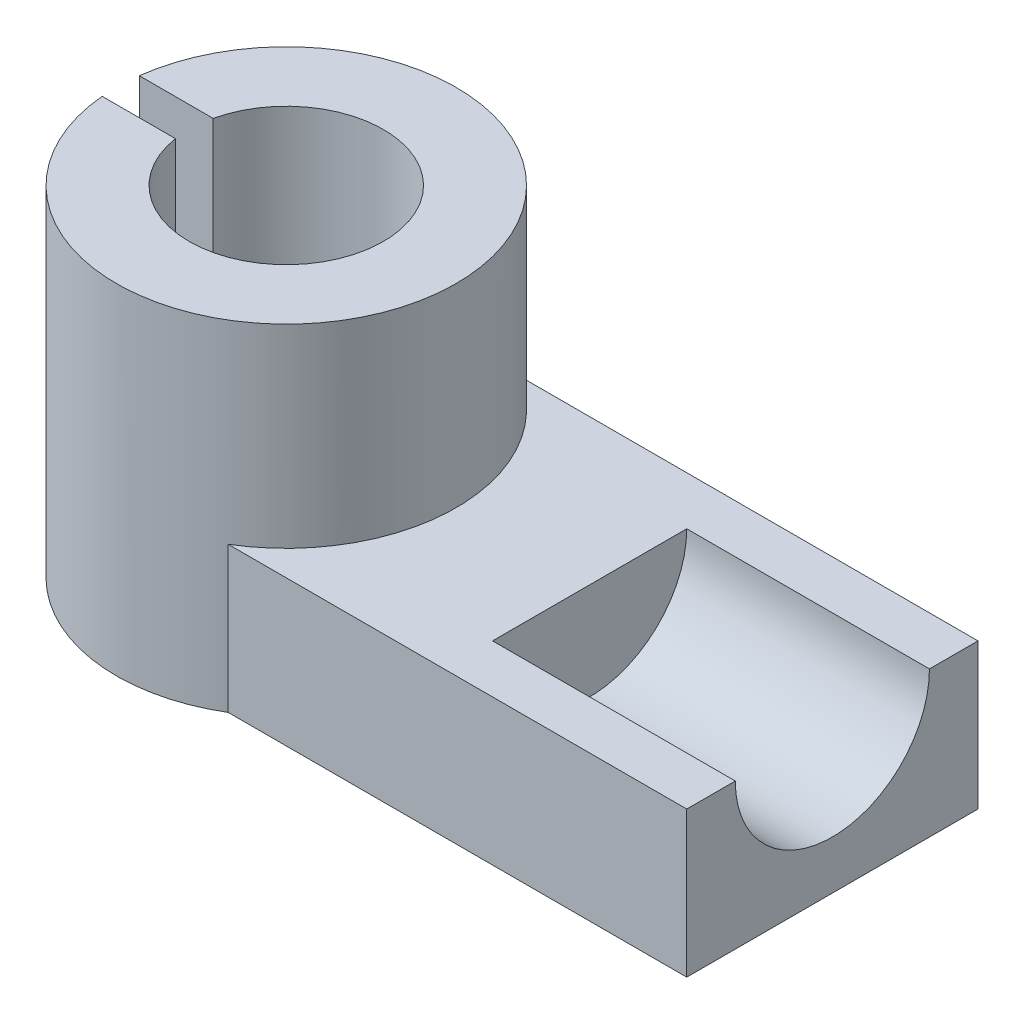
ISO-10303-21;
HEADER;
FILE_DESCRIPTION(('STEP AP214'),'2;1');
FILE_NAME('part.step','',(''),(''),'','','');
FILE_SCHEMA(('AUTOMOTIVE_DESIGN { 1 0 10303 214 1 1 1 1 }'));
ENDSEC;
DATA;
#1=APPLICATION_CONTEXT('core data for automotive mechanical design processes');
#2=APPLICATION_PROTOCOL_DEFINITION('international standard','automotive_design',2000,#1);
#3=PRODUCT_CONTEXT('',#1,'mechanical');
#4=PRODUCT('Part','Part','',(#3));
#5=PRODUCT_RELATED_PRODUCT_CATEGORY('part','',(#4));
#6=PRODUCT_DEFINITION_FORMATION('','',#4);
#7=PRODUCT_DEFINITION_CONTEXT('part definition',#1,'design');
#8=PRODUCT_DEFINITION('design','',#6,#7);
#9=PRODUCT_DEFINITION_SHAPE('','',#8);
#10=(LENGTH_UNIT() NAMED_UNIT(*) SI_UNIT(.MILLI.,.METRE.));
#11=(NAMED_UNIT(*) PLANE_ANGLE_UNIT() SI_UNIT($,.RADIAN.));
#12=(NAMED_UNIT(*) SI_UNIT($,.STERADIAN.) SOLID_ANGLE_UNIT());
#13=UNCERTAINTY_MEASURE_WITH_UNIT(LENGTH_MEASURE(1.E-05),#10,'distance_accuracy_value','');
#14=(GEOMETRIC_REPRESENTATION_CONTEXT(3) GLOBAL_UNCERTAINTY_ASSIGNED_CONTEXT((#13)) GLOBAL_UNIT_ASSIGNED_CONTEXT((#10,
#11,#12)) REPRESENTATION_CONTEXT('',''));
#15=CARTESIAN_POINT('',(0.,0.,0.));
#16=DIRECTION('',(0.,0.,1.));
#17=DIRECTION('',(1.,0.,0.));
#18=AXIS2_PLACEMENT_3D('',#15,#16,#17);
#19=CARTESIAN_POINT('',(0.,24.,0.));
#20=DIRECTION('',(0.,0.,-1.));
#21=DIRECTION('',(-1.,0.,0.));
#22=AXIS2_PLACEMENT_3D('',#19,#20,#21);
#23=PLANE('',#22);
#24=DIRECTION('',(1.,0.,0.));
#25=VECTOR('',#24,1.);
#26=CARTESIAN_POINT('',(0.,0.,0.));
#27=LINE('',#26,#25);
#28=CARTESIAN_POINT('',(14.422205101856,0.,0.));
#29=VERTEX_POINT('',#28);
#30=CARTESIAN_POINT('',(90.,0.,0.));
#31=VERTEX_POINT('',#30);
#32=EDGE_CURVE('E152',#29,#31,#27,.T.);
#33=ORIENTED_EDGE('',*,*,#32,.T.);
#34=DIRECTION('',(0.,-1.,0.));
#35=VECTOR('',#34,1.);
#36=CARTESIAN_POINT('',(90.,24.,0.));
#37=LINE('',#36,#35);
#38=CARTESIAN_POINT('',(90.,24.,0.));
#39=VERTEX_POINT('',#38);
#40=EDGE_CURVE('E168',#39,#31,#37,.T.);
#41=ORIENTED_EDGE('',*,*,#40,.F.);
#42=DIRECTION('',(1.,0.,0.));
#43=VECTOR('',#42,1.);
#44=CARTESIAN_POINT('',(0.,24.,0.));
#45=LINE('',#44,#43);
#46=CARTESIAN_POINT('',(14.422205101856,24.,0.));
#47=VERTEX_POINT('',#46);
#48=EDGE_CURVE('E140',#47,#39,#45,.T.);
#49=ORIENTED_EDGE('',*,*,#48,.F.);
#50=DIRECTION('',(0.,-1.,0.));
#51=VECTOR('',#50,1.);
#52=CARTESIAN_POINT('',(14.422205101856,24.,0.));
#53=LINE('',#52,#51);
#54=EDGE_CURVE('E172',#47,#29,#53,.T.);
#55=ORIENTED_EDGE('',*,*,#54,.T.);
#56=EDGE_LOOP('',(#33,#41,#49,#55));
#57=FACE_BOUND('',#56,.T.);
#58=ADVANCED_FACE('F41',(#57),#23,.F.);
#59=CARTESIAN_POINT('',(90.,24.,0.));
#60=DIRECTION('',(-1.,0.,0.));
#61=DIRECTION('',(0.,0.,1.));
#62=AXIS2_PLACEMENT_3D('',#59,#60,#61);
#63=PLANE('',#62);
#64=DIRECTION('',(0.,0.,-1.));
#65=VECTOR('',#64,1.);
#66=CARTESIAN_POINT('',(90.,24.,0.));
#67=LINE('',#66,#65);
#68=CARTESIAN_POINT('',(90.,24.,-40.));
#69=VERTEX_POINT('',#68);
#70=CARTESIAN_POINT('',(90.,24.,-48.));
#71=VERTEX_POINT('',#70);
#72=EDGE_CURVE('E130',#69,#71,#67,.T.);
#73=ORIENTED_EDGE('',*,*,#72,.F.);
#74=CARTESIAN_POINT('',(90.,24.,-24.));
#75=DIRECTION('',(1.,0.,0.));
#76=DIRECTION('',(0.,0.,-1.));
#77=AXIS2_PLACEMENT_3D('',#74,#75,#76);
#78=CIRCLE('',#77,16.);
#79=CARTESIAN_POINT('',(90.,24.,-7.99999999999998));
#80=VERTEX_POINT('',#79);
#81=EDGE_CURVE('E116',#80,#69,#78,.T.);
#82=ORIENTED_EDGE('',*,*,#81,.F.);
#83=EDGE_CURVE('E139',#39,#80,#67,.T.);
#84=ORIENTED_EDGE('',*,*,#83,.F.);
#85=ORIENTED_EDGE('',*,*,#40,.T.);
#86=DIRECTION('',(0.,0.,-1.));
#87=VECTOR('',#86,1.);
#88=CARTESIAN_POINT('',(90.,0.,0.));
#89=LINE('',#88,#87);
#90=CARTESIAN_POINT('',(90.,0.,-48.));
#91=VERTEX_POINT('',#90);
#92=EDGE_CURVE('E155',#31,#91,#89,.T.);
#93=ORIENTED_EDGE('',*,*,#92,.T.);
#94=DIRECTION('',(0.,-1.,0.));
#95=VECTOR('',#94,1.);
#96=CARTESIAN_POINT('',(90.,24.,-48.));
#97=LINE('',#96,#95);
#98=EDGE_CURVE('E136',#71,#91,#97,.T.);
#99=ORIENTED_EDGE('',*,*,#98,.F.);
#100=EDGE_LOOP('',(#73,#82,#84,#85,#93,#99));
#101=FACE_BOUND('',#100,.T.);
#102=ADVANCED_FACE('F134',(#101),#63,.F.);
#103=CARTESIAN_POINT('',(0.,24.,-48.));
#104=DIRECTION('',(0.,0.,-1.));
#105=DIRECTION('',(-1.,0.,0.));
#106=AXIS2_PLACEMENT_3D('',#103,#104,#105);
#107=PLANE('',#106);
#108=DIRECTION('',(1.,0.,0.));
#109=VECTOR('',#108,1.);
#110=CARTESIAN_POINT('',(0.,0.,-48.));
#111=LINE('',#110,#109);
#112=CARTESIAN_POINT('',(14.422205101856,0.,-48.));
#113=VERTEX_POINT('',#112);
#114=EDGE_CURVE('E159',#113,#91,#111,.T.);
#115=ORIENTED_EDGE('',*,*,#114,.F.);
#116=DIRECTION('',(0.,-1.,0.));
#117=VECTOR('',#116,1.);
#118=CARTESIAN_POINT('',(14.422205101856,24.,-48.));
#119=LINE('',#118,#117);
#120=CARTESIAN_POINT('',(14.422205101856,24.,-48.));
#121=VERTEX_POINT('',#120);
#122=EDGE_CURVE('E151',#121,#113,#119,.T.);
#123=ORIENTED_EDGE('',*,*,#122,.F.);
#124=DIRECTION('',(1.,0.,0.));
#125=VECTOR('',#124,1.);
#126=CARTESIAN_POINT('',(0.,24.,-48.));
#127=LINE('',#126,#125);
#128=EDGE_CURVE('E144',#121,#71,#127,.T.);
#129=ORIENTED_EDGE('',*,*,#128,.T.);
#130=ORIENTED_EDGE('',*,*,#98,.T.);
#131=EDGE_LOOP('',(#115,#123,#129,#130));
#132=FACE_BOUND('',#131,.T.);
#133=ADVANCED_FACE('F224',(#132),#107,.T.);
#134=CARTESIAN_POINT('',(0.,24.,0.));
#135=DIRECTION('',(0.,1.,0.));
#136=DIRECTION('',(0.,0.,1.));
#137=AXIS2_PLACEMENT_3D('',#134,#135,#136);
#138=PLANE('',#137);
#139=DIRECTION('',(1.,0.,0.));
#140=VECTOR('',#139,1.);
#141=CARTESIAN_POINT('',(50.,24.,-7.99999999999998));
#142=LINE('',#141,#140);
#143=CARTESIAN_POINT('',(50.,24.,-7.99999999999998));
#144=VERTEX_POINT('',#143);
#145=EDGE_CURVE('E11',#144,#80,#142,.T.);
#146=ORIENTED_EDGE('',*,*,#145,.F.);
#147=DIRECTION('',(0.,0.,-1.));
#148=VECTOR('',#147,1.);
#149=CARTESIAN_POINT('',(50.,24.,0.));
#150=LINE('',#149,#148);
#151=CARTESIAN_POINT('',(50.,24.,-40.));
#152=VERTEX_POINT('',#151);
#153=EDGE_CURVE('E132',#144,#152,#150,.T.);
#154=ORIENTED_EDGE('',*,*,#153,.T.);
#155=DIRECTION('',(1.,0.,0.));
#156=VECTOR('',#155,1.);
#157=CARTESIAN_POINT('',(50.,24.,-40.));
#158=LINE('',#157,#156);
#159=EDGE_CURVE('E49',#69,#152,#158,.F.);
#160=ORIENTED_EDGE('',*,*,#159,.F.);
#161=ORIENTED_EDGE('',*,*,#72,.T.);
#162=ORIENTED_EDGE('',*,*,#128,.F.);
#163=CARTESIAN_POINT('',(0.,24.,-24.));
#164=DIRECTION('',(0.,1.,0.));
#165=DIRECTION('',(0.,0.,1.));
#166=AXIS2_PLACEMENT_3D('',#163,#164,#165);
#167=CIRCLE('',#166,28.);
#168=EDGE_CURVE('E145',#47,#121,#167,.T.);
#169=ORIENTED_EDGE('',*,*,#168,.F.);
#170=ORIENTED_EDGE('',*,*,#48,.T.);
#171=ORIENTED_EDGE('',*,*,#83,.T.);
#172=EDGE_LOOP('',(#146,#154,#160,#161,#162,#169,#170,#171));
#173=FACE_BOUND('',#172,.T.);
#174=ADVANCED_FACE('F128',(#173),#138,.T.);
#175=CARTESIAN_POINT('',(0.,0.,0.));
#176=DIRECTION('',(0.,1.,0.));
#177=DIRECTION('',(0.,0.,1.));
#178=AXIS2_PLACEMENT_3D('',#175,#176,#177);
#179=PLANE('',#178);
#180=CARTESIAN_POINT('',(0.,0.,-24.));
#181=DIRECTION('',(0.,1.,0.));
#182=DIRECTION('',(0.,0.,1.));
#183=AXIS2_PLACEMENT_3D('',#180,#181,#182);
#184=CIRCLE('',#183,28.);
#185=CARTESIAN_POINT('',(-27.892800444766,0.,-21.5522084752856));
#186=VERTEX_POINT('',#185);
#187=EDGE_CURVE('E211',#186,#29,#184,.T.);
#188=ORIENTED_EDGE('',*,*,#187,.F.);
#189=DIRECTION('',(1.,0.,0.));
#190=VECTOR('',#189,1.);
#191=CARTESIAN_POINT('',(-40.6619448927141,0.,-21.5522084752856));
#192=LINE('',#191,#190);
#193=CARTESIAN_POINT('',(-15.8116512942683,0.,-21.5522084752856));
#194=VERTEX_POINT('',#193);
#195=EDGE_CURVE('E238',#186,#194,#192,.T.);
#196=ORIENTED_EDGE('',*,*,#195,.T.);
#197=CARTESIAN_POINT('',(0.,0.,-24.));
#198=DIRECTION('',(0.,1.,0.));
#199=DIRECTION('',(0.,0.,1.));
#200=AXIS2_PLACEMENT_3D('',#197,#198,#199);
#201=CIRCLE('',#200,16.);
#202=CARTESIAN_POINT('',(-15.6006991813864,0.,-27.5522084752856));
#203=VERTEX_POINT('',#202);
#204=EDGE_CURVE('E198',#194,#203,#201,.T.);
#205=ORIENTED_EDGE('',*,*,#204,.T.);
#206=DIRECTION('',(-1.,0.,0.));
#207=VECTOR('',#206,1.);
#208=CARTESIAN_POINT('',(-40.6619448927141,0.,-27.5522084752856));
#209=LINE('',#208,#207);
#210=CARTESIAN_POINT('',(-27.7737612675725,0.,-27.5522084752856));
#211=VERTEX_POINT('',#210);
#212=EDGE_CURVE('E231',#203,#211,#209,.T.);
#213=ORIENTED_EDGE('',*,*,#212,.T.);
#214=EDGE_CURVE('E205',#113,#211,#184,.T.);
#215=ORIENTED_EDGE('',*,*,#214,.F.);
#216=ORIENTED_EDGE('',*,*,#114,.T.);
#217=ORIENTED_EDGE('',*,*,#92,.F.);
#218=ORIENTED_EDGE('',*,*,#32,.F.);
#219=EDGE_LOOP('',(#188,#196,#205,#213,#215,#216,#217,#218));
#220=FACE_BOUND('',#219,.T.);
#221=ADVANCED_FACE('F228',(#220),#179,.F.);
#222=CARTESIAN_POINT('',(0.,56.,-24.));
#223=DIRECTION('',(0.,-1.,0.));
#224=DIRECTION('',(0.,0.,-1.));
#225=AXIS2_PLACEMENT_3D('',#222,#223,#224);
#226=CYLINDRICAL_SURFACE('',#225,28.);
#227=CARTESIAN_POINT('',(0.,56.,-24.));
#228=DIRECTION('',(0.,1.,0.));
#229=DIRECTION('',(0.,0.,1.));
#230=AXIS2_PLACEMENT_3D('',#227,#228,#229);
#231=CIRCLE('',#230,28.);
#232=CARTESIAN_POINT('',(-27.892800444766,56.,-21.5522084752856));
#233=VERTEX_POINT('',#232);
#234=CARTESIAN_POINT('',(-27.7737612675725,56.,-27.5522084752856));
#235=VERTEX_POINT('',#234);
#236=EDGE_CURVE('E156',#233,#235,#231,.T.);
#237=ORIENTED_EDGE('',*,*,#236,.F.);
#238=DIRECTION('',(0.,-1.,0.));
#239=VECTOR('',#238,1.);
#240=CARTESIAN_POINT('',(-27.892800444766,56.,-21.5522084752856));
#241=LINE('',#240,#239);
#242=EDGE_CURVE('E63',#233,#186,#241,.T.);
#243=ORIENTED_EDGE('',*,*,#242,.T.);
#244=ORIENTED_EDGE('',*,*,#187,.T.);
#245=ORIENTED_EDGE('',*,*,#54,.F.);
#246=ORIENTED_EDGE('',*,*,#168,.T.);
#247=ORIENTED_EDGE('',*,*,#122,.T.);
#248=ORIENTED_EDGE('',*,*,#214,.T.);
#249=DIRECTION('',(0.,-1.,0.));
#250=VECTOR('',#249,1.);
#251=CARTESIAN_POINT('',(-27.7737612675725,56.,-27.5522084752856));
#252=LINE('',#251,#250);
#253=EDGE_CURVE('E200',#211,#235,#252,.F.);
#254=ORIENTED_EDGE('',*,*,#253,.T.);
#255=EDGE_LOOP('',(#237,#243,#244,#245,#246,#247,#248,#254));
#256=FACE_BOUND('',#255,.T.);
#257=ADVANCED_FACE('F220',(#256),#226,.T.);
#258=CARTESIAN_POINT('',(0.,56.,-24.));
#259=DIRECTION('',(0.,-1.,0.));
#260=DIRECTION('',(0.,0.,-1.));
#261=AXIS2_PLACEMENT_3D('',#258,#259,#260);
#262=CYLINDRICAL_SURFACE('',#261,16.);
#263=DIRECTION('',(0.,-1.,0.));
#264=VECTOR('',#263,1.);
#265=CARTESIAN_POINT('',(-15.8116512942683,56.,-21.5522084752856));
#266=LINE('',#265,#264);
#267=CARTESIAN_POINT('',(-15.8116512942683,56.,-21.5522084752856));
#268=VERTEX_POINT('',#267);
#269=EDGE_CURVE('E185',#268,#194,#266,.T.);
#270=ORIENTED_EDGE('',*,*,#269,.F.);
#271=CARTESIAN_POINT('',(0.,56.,-24.));
#272=DIRECTION('',(0.,1.,0.));
#273=DIRECTION('',(0.,0.,1.));
#274=AXIS2_PLACEMENT_3D('',#271,#272,#273);
#275=CIRCLE('',#274,16.);
#276=CARTESIAN_POINT('',(-15.6006991813864,56.,-27.5522084752856));
#277=VERTEX_POINT('',#276);
#278=EDGE_CURVE('E196',#268,#277,#275,.T.);
#279=ORIENTED_EDGE('',*,*,#278,.T.);
#280=DIRECTION('',(0.,-1.,0.));
#281=VECTOR('',#280,1.);
#282=CARTESIAN_POINT('',(-15.6006991813864,56.,-27.5522084752856));
#283=LINE('',#282,#281);
#284=EDGE_CURVE('E235',#203,#277,#283,.F.);
#285=ORIENTED_EDGE('',*,*,#284,.F.);
#286=ORIENTED_EDGE('',*,*,#204,.F.);
#287=EDGE_LOOP('',(#270,#279,#285,#286));
#288=FACE_BOUND('',#287,.T.);
#289=ADVANCED_FACE('F194',(#288),#262,.F.);
#290=CARTESIAN_POINT('',(0.,56.,0.));
#291=DIRECTION('',(0.,1.,0.));
#292=DIRECTION('',(0.,0.,1.));
#293=AXIS2_PLACEMENT_3D('',#290,#291,#292);
#294=PLANE('',#293);
#295=DIRECTION('',(1.,0.,0.));
#296=VECTOR('',#295,1.);
#297=CARTESIAN_POINT('',(0.,56.,-21.5522084752856));
#298=LINE('',#297,#296);
#299=EDGE_CURVE('E179',#233,#268,#298,.T.);
#300=ORIENTED_EDGE('',*,*,#299,.F.);
#301=ORIENTED_EDGE('',*,*,#236,.T.);
#302=DIRECTION('',(-1.,0.,0.));
#303=VECTOR('',#302,1.);
#304=CARTESIAN_POINT('',(0.,56.,-27.5522084752856));
#305=LINE('',#304,#303);
#306=EDGE_CURVE('E176',#277,#235,#305,.T.);
#307=ORIENTED_EDGE('',*,*,#306,.F.);
#308=ORIENTED_EDGE('',*,*,#278,.F.);
#309=EDGE_LOOP('',(#300,#301,#307,#308));
#310=FACE_BOUND('',#309,.T.);
#311=ADVANCED_FACE('F203',(#310),#294,.T.);
#312=CARTESIAN_POINT('',(-40.6619448927141,0.,-27.5522084752856));
#313=DIRECTION('',(0.,0.,-1.));
#314=DIRECTION('',(-1.,0.,0.));
#315=AXIS2_PLACEMENT_3D('',#312,#313,#314);
#316=PLANE('',#315);
#317=ORIENTED_EDGE('',*,*,#212,.F.);
#318=ORIENTED_EDGE('',*,*,#284,.T.);
#319=ORIENTED_EDGE('',*,*,#306,.T.);
#320=ORIENTED_EDGE('',*,*,#253,.F.);
#321=EDGE_LOOP('',(#317,#318,#319,#320));
#322=FACE_BOUND('',#321,.T.);
#323=ADVANCED_FACE('F269',(#322),#316,.F.);
#324=CARTESIAN_POINT('',(-40.6619448927141,0.,-21.5522084752856));
#325=DIRECTION('',(0.,0.,1.));
#326=DIRECTION('',(1.,0.,0.));
#327=AXIS2_PLACEMENT_3D('',#324,#325,#326);
#328=PLANE('',#327);
#329=ORIENTED_EDGE('',*,*,#299,.T.);
#330=ORIENTED_EDGE('',*,*,#269,.T.);
#331=ORIENTED_EDGE('',*,*,#195,.F.);
#332=ORIENTED_EDGE('',*,*,#242,.F.);
#333=EDGE_LOOP('',(#329,#330,#331,#332));
#334=FACE_BOUND('',#333,.T.);
#335=ADVANCED_FACE('F184',(#334),#328,.F.);
#336=CARTESIAN_POINT('',(50.,24.,-24.));
#337=DIRECTION('',(1.,0.,0.));
#338=DIRECTION('',(0.,0.,-1.));
#339=AXIS2_PLACEMENT_3D('',#336,#337,#338);
#340=CYLINDRICAL_SURFACE('',#339,16.);
#341=ORIENTED_EDGE('',*,*,#145,.T.);
#342=ORIENTED_EDGE('',*,*,#81,.T.);
#343=ORIENTED_EDGE('',*,*,#159,.T.);
#344=CARTESIAN_POINT('',(50.,24.,-24.));
#345=DIRECTION('',(1.,0.,0.));
#346=DIRECTION('',(0.,0.,-1.));
#347=AXIS2_PLACEMENT_3D('',#344,#345,#346);
#348=CIRCLE('',#347,16.);
#349=EDGE_CURVE('E55',#144,#152,#348,.T.);
#350=ORIENTED_EDGE('',*,*,#349,.F.);
#351=EDGE_LOOP('',(#341,#342,#343,#350));
#352=FACE_BOUND('',#351,.T.);
#353=ADVANCED_FACE('F118',(#352),#340,.F.);
#354=CARTESIAN_POINT('',(50.,24.,-24.));
#355=DIRECTION('',(1.,0.,0.));
#356=DIRECTION('',(0.,0.,-1.));
#357=AXIS2_PLACEMENT_3D('',#354,#355,#356);
#358=PLANE('',#357);
#359=ORIENTED_EDGE('',*,*,#349,.T.);
#360=ORIENTED_EDGE('',*,*,#153,.F.);
#361=EDGE_LOOP('',(#359,#360));
#362=FACE_BOUND('',#361,.T.);
#363=ADVANCED_FACE('F276',(#362),#358,.T.);
#364=CLOSED_SHELL('',(#58,#102,#133,#174,#221,#257,#289,#311,#323,#335,#353,#363));
#365=MANIFOLD_SOLID_BREP('B2',#364);
#366=ADVANCED_BREP_SHAPE_REPRESENTATION('',(#18,#365),#14);
#367=SHAPE_DEFINITION_REPRESENTATION(#9,#366);
ENDSEC;
END-ISO-10303-21;
